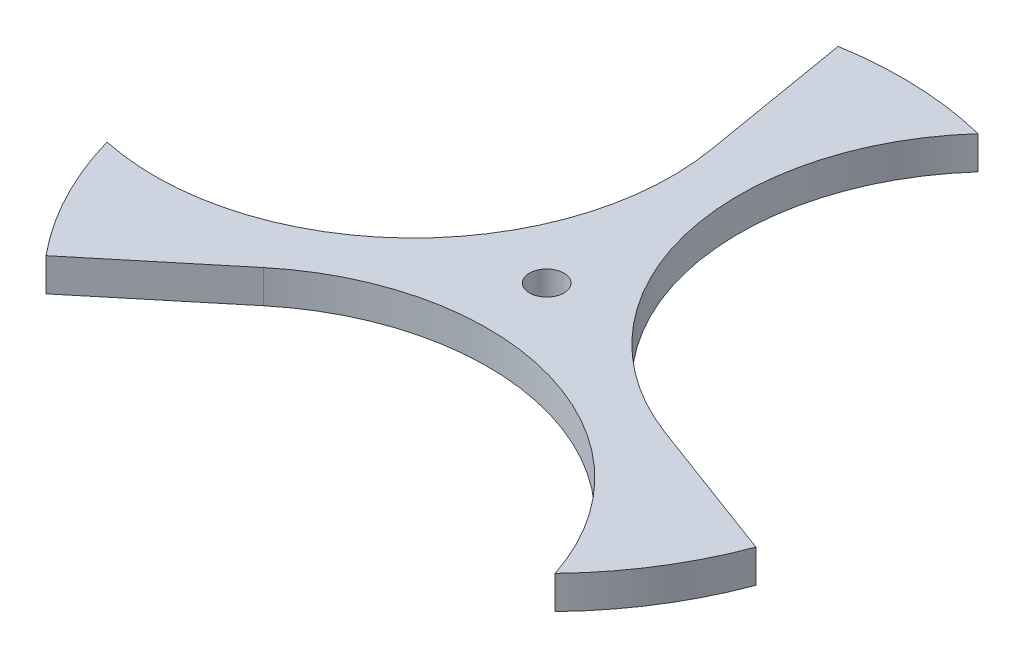
ISO-10303-21;
HEADER;
FILE_DESCRIPTION(('STEP AP214'),'2;1');
FILE_NAME('part.step','',(''),(''),'','','');
FILE_SCHEMA(('AUTOMOTIVE_DESIGN { 1 0 10303 214 1 1 1 1 }'));
ENDSEC;
DATA;
#1=APPLICATION_CONTEXT('core data for automotive mechanical design processes');
#2=APPLICATION_PROTOCOL_DEFINITION('international standard','automotive_design',2000,#1);
#3=PRODUCT_CONTEXT('',#1,'mechanical');
#4=PRODUCT('Part','Part','',(#3));
#5=PRODUCT_RELATED_PRODUCT_CATEGORY('part','',(#4));
#6=PRODUCT_DEFINITION_FORMATION('','',#4);
#7=PRODUCT_DEFINITION_CONTEXT('part definition',#1,'design');
#8=PRODUCT_DEFINITION('design','',#6,#7);
#9=PRODUCT_DEFINITION_SHAPE('','',#8);
#10=(LENGTH_UNIT() NAMED_UNIT(*) SI_UNIT(.MILLI.,.METRE.));
#11=(NAMED_UNIT(*) PLANE_ANGLE_UNIT() SI_UNIT($,.RADIAN.));
#12=(NAMED_UNIT(*) SI_UNIT($,.STERADIAN.) SOLID_ANGLE_UNIT());
#13=UNCERTAINTY_MEASURE_WITH_UNIT(LENGTH_MEASURE(1.E-05),#10,'distance_accuracy_value','');
#14=(GEOMETRIC_REPRESENTATION_CONTEXT(3) GLOBAL_UNCERTAINTY_ASSIGNED_CONTEXT((#13)) GLOBAL_UNIT_ASSIGNED_CONTEXT((#10,
#11,#12)) REPRESENTATION_CONTEXT('',''));
#15=CARTESIAN_POINT('',(0.,0.,0.));
#16=DIRECTION('',(0.,0.,1.));
#17=DIRECTION('',(1.,0.,0.));
#18=AXIS2_PLACEMENT_3D('',#15,#16,#17);
#19=CARTESIAN_POINT('',(1.81029657284749,3.048,60.2978312322951));
#20=DIRECTION('',(0.,1.,0.));
#21=DIRECTION('',(0.,0.,1.));
#22=AXIS2_PLACEMENT_3D('',#19,#20,#21);
#23=PLANE('',#22);
#24=CARTESIAN_POINT('',(1.81029657284749,3.048,60.2978312322951));
#25=DIRECTION('',(0.,-1.,0.));
#26=DIRECTION('',(0.,0.,1.));
#27=AXIS2_PLACEMENT_3D('',#24,#25,#26);
#28=CIRCLE('',#27,47.625);
#29=CARTESIAN_POINT('',(-28.5363220622247,3.048,23.5932897909763));
#30=VERTEX_POINT('',#29);
#31=CARTESIAN_POINT('',(47.093148028681,3.048,45.546424891579));
#32=VERTEX_POINT('',#31);
#33=EDGE_CURVE('E163',#30,#32,#28,.T.);
#34=ORIENTED_EDGE('',*,*,#33,.T.);
#35=CARTESIAN_POINT('',(0.,3.048,0.));
#36=DIRECTION('',(0.,1.,0.));
#37=DIRECTION('',(0.,0.,1.));
#38=AXIS2_PLACEMENT_3D('',#35,#36,#37);
#39=CIRCLE('',#38,65.5151998520611);
#40=CARTESIAN_POINT('',(61.3995568393179,3.048,22.8546676105973));
#41=VERTEX_POINT('',#40);
#42=EDGE_CURVE('E106',#32,#41,#39,.T.);
#43=ORIENTED_EDGE('',*,*,#42,.T.);
#44=DIRECTION('',(-0.937180333387722,0.,-0.348845270444188));
#45=VECTOR('',#44,1.);
#46=CARTESIAN_POINT('',(34.7005493489459,3.048,12.9165349409727));
#47=LINE('',#46,#45);
#48=CARTESIAN_POINT('',(34.7005493489459,3.048,12.9165349409727));
#49=VERTEX_POINT('',#48);
#50=EDGE_CURVE('E181',#41,#49,#47,.T.);
#51=ORIENTED_EDGE('',*,*,#50,.T.);
#52=CARTESIAN_POINT('',(51.3143053538503,3.048,-31.7166784366176));
#53=DIRECTION('',(0.,-1.,0.));
#54=DIRECTION('',(0.,0.,1.));
#55=AXIS2_PLACEMENT_3D('',#52,#53,#54);
#56=CIRCLE('',#55,47.625);
#57=CARTESIAN_POINT('',(15.8977869933265,3.048,-63.5570749828084));
#58=VERTEX_POINT('',#57);
#59=EDGE_CURVE('E198',#49,#58,#56,.T.);
#60=ORIENTED_EDGE('',*,*,#59,.T.);
#61=CARTESIAN_POINT('',(0.,3.048,0.));
#62=DIRECTION('',(0.,1.,0.));
#63=DIRECTION('',(0.,0.,1.));
#64=AXIS2_PLACEMENT_3D('',#61,#62,#63);
#65=CIRCLE('',#64,65.5151998520611);
#66=CARTESIAN_POINT('',(-10.9070556738326,3.048,-64.6009098092544));
#67=VERTEX_POINT('',#66);
#68=EDGE_CURVE('E197',#58,#67,#65,.T.);
#69=ORIENTED_EDGE('',*,*,#68,.T.);
#70=DIRECTION('',(0.166481300499146,0.,0.98604461186303));
#71=VECTOR('',#70,1.);
#72=CARTESIAN_POINT('',(-6.16422728672149,3.048,-36.509824731949));
#73=LINE('',#72,#71);
#74=CARTESIAN_POINT('',(-6.16422728672147,3.048,-36.509824731949));
#75=VERTEX_POINT('',#74);
#76=EDGE_CURVE('E128',#67,#75,#73,.T.);
#77=ORIENTED_EDGE('',*,*,#76,.T.);
#78=CARTESIAN_POINT('',(-53.1246019266983,3.048,-28.5811527956771));
#79=DIRECTION('',(0.,-1.,0.));
#80=DIRECTION('',(0.,0.,1.));
#81=AXIS2_PLACEMENT_3D('',#78,#79,#80);
#82=CIRCLE('',#81,47.625);
#83=CARTESIAN_POINT('',(-62.9909350220076,3.048,18.01065009123));
#84=VERTEX_POINT('',#83);
#85=EDGE_CURVE('E122',#75,#84,#82,.T.);
#86=ORIENTED_EDGE('',*,*,#85,.T.);
#87=CARTESIAN_POINT('',(0.,3.048,0.));
#88=DIRECTION('',(0.,1.,0.));
#89=DIRECTION('',(0.,0.,1.));
#90=AXIS2_PLACEMENT_3D('',#87,#88,#89);
#91=CIRCLE('',#90,65.5151998520611);
#92=CARTESIAN_POINT('',(-50.4925011654858,3.048,41.746242198657));
#93=VERTEX_POINT('',#92);
#94=EDGE_CURVE('E126',#84,#93,#91,.T.);
#95=ORIENTED_EDGE('',*,*,#94,.T.);
#96=DIRECTION('',(0.770699032888583,0.,-0.637199341418839));
#97=VECTOR('',#96,1.);
#98=CARTESIAN_POINT('',(-28.5363220622247,3.048,23.5932897909763));
#99=LINE('',#98,#97);
#100=EDGE_CURVE('E60',#93,#30,#99,.T.);
#101=ORIENTED_EDGE('',*,*,#100,.T.);
#102=EDGE_LOOP('',(#34,#43,#51,#60,#69,#77,#86,#95,#101));
#103=FACE_BOUND('',#102,.T.);
#104=CARTESIAN_POINT('',(0.,3.048,0.));
#105=DIRECTION('',(0.,1.,0.));
#106=DIRECTION('',(0.,0.,1.));
#107=AXIS2_PLACEMENT_3D('',#104,#105,#106);
#108=CIRCLE('',#107,3.175);
#109=CARTESIAN_POINT('',(0.,3.048,3.17500000000003));
#110=VERTEX_POINT('',#109);
#111=EDGE_CURVE('E150',#110,#110,#108,.T.);
#112=ORIENTED_EDGE('',*,*,#111,.F.);
#113=EDGE_LOOP('',(#112));
#114=FACE_BOUND('',#113,.T.);
#115=ADVANCED_FACE('F43',(#103,#114),#23,.T.);
#116=CARTESIAN_POINT('',(1.81029657284749,-3.048,60.2978312322951));
#117=DIRECTION('',(0.,1.,0.));
#118=DIRECTION('',(0.,0.,1.));
#119=AXIS2_PLACEMENT_3D('',#116,#117,#118);
#120=PLANE('',#119);
#121=CARTESIAN_POINT('',(1.81029657284749,-3.048,60.2978312322951));
#122=DIRECTION('',(0.,-1.,0.));
#123=DIRECTION('',(0.,0.,1.));
#124=AXIS2_PLACEMENT_3D('',#121,#122,#123);
#125=CIRCLE('',#124,47.625);
#126=CARTESIAN_POINT('',(-28.5363220622247,-3.048,23.5932897909763));
#127=VERTEX_POINT('',#126);
#128=CARTESIAN_POINT('',(47.093148028681,-3.048,45.546424891579));
#129=VERTEX_POINT('',#128);
#130=EDGE_CURVE('E146',#127,#129,#125,.T.);
#131=ORIENTED_EDGE('',*,*,#130,.F.);
#132=DIRECTION('',(0.770699032888583,0.,-0.637199341418839));
#133=VECTOR('',#132,1.);
#134=CARTESIAN_POINT('',(-28.5363220622247,-3.048,23.5932897909763));
#135=LINE('',#134,#133);
#136=CARTESIAN_POINT('',(-50.4925011654858,-3.048,41.746242198657));
#137=VERTEX_POINT('',#136);
#138=EDGE_CURVE('E98',#137,#127,#135,.T.);
#139=ORIENTED_EDGE('',*,*,#138,.F.);
#140=CARTESIAN_POINT('',(0.,-3.048,0.));
#141=DIRECTION('',(0.,1.,0.));
#142=DIRECTION('',(0.,0.,1.));
#143=AXIS2_PLACEMENT_3D('',#140,#141,#142);
#144=CIRCLE('',#143,65.5151998520611);
#145=CARTESIAN_POINT('',(-62.9909350220076,-3.048,18.01065009123));
#146=VERTEX_POINT('',#145);
#147=EDGE_CURVE('E92',#146,#137,#144,.T.);
#148=ORIENTED_EDGE('',*,*,#147,.F.);
#149=CARTESIAN_POINT('',(-53.1246019266983,-3.048,-28.5811527956771));
#150=DIRECTION('',(0.,-1.,0.));
#151=DIRECTION('',(0.,0.,1.));
#152=AXIS2_PLACEMENT_3D('',#149,#150,#151);
#153=CIRCLE('',#152,47.625);
#154=CARTESIAN_POINT('',(-6.16422728672147,-3.048,-36.509824731949));
#155=VERTEX_POINT('',#154);
#156=EDGE_CURVE('E136',#155,#146,#153,.T.);
#157=ORIENTED_EDGE('',*,*,#156,.F.);
#158=DIRECTION('',(0.166481300499146,0.,0.98604461186303));
#159=VECTOR('',#158,1.);
#160=CARTESIAN_POINT('',(-6.16422728672149,-3.048,-36.509824731949));
#161=LINE('',#160,#159);
#162=CARTESIAN_POINT('',(-10.9070556738326,-3.048,-64.6009098092544));
#163=VERTEX_POINT('',#162);
#164=EDGE_CURVE('E158',#163,#155,#161,.T.);
#165=ORIENTED_EDGE('',*,*,#164,.F.);
#166=CARTESIAN_POINT('',(0.,-3.048,0.));
#167=DIRECTION('',(0.,1.,0.));
#168=DIRECTION('',(0.,0.,1.));
#169=AXIS2_PLACEMENT_3D('',#166,#167,#168);
#170=CIRCLE('',#169,65.5151998520611);
#171=CARTESIAN_POINT('',(15.8977869933265,-3.048,-63.5570749828084));
#172=VERTEX_POINT('',#171);
#173=EDGE_CURVE('E156',#172,#163,#170,.T.);
#174=ORIENTED_EDGE('',*,*,#173,.F.);
#175=CARTESIAN_POINT('',(51.3143053538503,-3.048,-31.7166784366176));
#176=DIRECTION('',(0.,-1.,0.));
#177=DIRECTION('',(0.,0.,1.));
#178=AXIS2_PLACEMENT_3D('',#175,#176,#177);
#179=CIRCLE('',#178,47.625);
#180=CARTESIAN_POINT('',(34.7005493489459,-3.048,12.9165349409727));
#181=VERTEX_POINT('',#180);
#182=EDGE_CURVE('E154',#181,#172,#179,.T.);
#183=ORIENTED_EDGE('',*,*,#182,.F.);
#184=DIRECTION('',(-0.937180333387722,0.,-0.348845270444188));
#185=VECTOR('',#184,1.);
#186=CARTESIAN_POINT('',(34.7005493489459,-3.048,12.9165349409727));
#187=LINE('',#186,#185);
#188=CARTESIAN_POINT('',(61.3995568393179,-3.048,22.8546676105973));
#189=VERTEX_POINT('',#188);
#190=EDGE_CURVE('E152',#189,#181,#187,.T.);
#191=ORIENTED_EDGE('',*,*,#190,.F.);
#192=CARTESIAN_POINT('',(0.,-3.048,0.));
#193=DIRECTION('',(0.,1.,0.));
#194=DIRECTION('',(0.,0.,1.));
#195=AXIS2_PLACEMENT_3D('',#192,#193,#194);
#196=CIRCLE('',#195,65.5151998520611);
#197=EDGE_CURVE('E149',#129,#189,#196,.T.);
#198=ORIENTED_EDGE('',*,*,#197,.F.);
#199=EDGE_LOOP('',(#131,#139,#148,#157,#165,#174,#183,#191,#198));
#200=FACE_BOUND('',#199,.T.);
#201=CARTESIAN_POINT('',(0.,-3.048,0.));
#202=DIRECTION('',(0.,1.,0.));
#203=DIRECTION('',(0.,0.,1.));
#204=AXIS2_PLACEMENT_3D('',#201,#202,#203);
#205=CIRCLE('',#204,3.175);
#206=CARTESIAN_POINT('',(0.,-3.048,3.17500000000003));
#207=VERTEX_POINT('',#206);
#208=EDGE_CURVE('E205',#207,#207,#205,.T.);
#209=ORIENTED_EDGE('',*,*,#208,.T.);
#210=EDGE_LOOP('',(#209));
#211=FACE_BOUND('',#210,.T.);
#212=ADVANCED_FACE('F185',(#200,#211),#120,.F.);
#213=CARTESIAN_POINT('',(1.81029657284749,3.048,60.2978312322951));
#214=DIRECTION('',(0.,-1.,0.));
#215=DIRECTION('',(0.,0.,-1.));
#216=AXIS2_PLACEMENT_3D('',#213,#214,#215);
#217=CYLINDRICAL_SURFACE('',#216,47.625);
#218=ORIENTED_EDGE('',*,*,#130,.T.);
#219=DIRECTION('',(0.,-1.,0.));
#220=VECTOR('',#219,1.);
#221=CARTESIAN_POINT('',(47.093148028681,3.048,45.546424891579));
#222=LINE('',#221,#220);
#223=EDGE_CURVE('E13',#32,#129,#222,.T.);
#224=ORIENTED_EDGE('',*,*,#223,.F.);
#225=ORIENTED_EDGE('',*,*,#33,.F.);
#226=DIRECTION('',(0.,-1.,0.));
#227=VECTOR('',#226,1.);
#228=CARTESIAN_POINT('',(-28.5363220622247,3.048,23.5932897909763));
#229=LINE('',#228,#227);
#230=EDGE_CURVE('E142',#30,#127,#229,.T.);
#231=ORIENTED_EDGE('',*,*,#230,.T.);
#232=EDGE_LOOP('',(#218,#224,#225,#231));
#233=FACE_BOUND('',#232,.T.);
#234=ADVANCED_FACE('F45',(#233),#217,.F.);
#235=CARTESIAN_POINT('',(0.,3.048,0.));
#236=DIRECTION('',(0.,-1.,0.));
#237=DIRECTION('',(0.,0.,-1.));
#238=AXIS2_PLACEMENT_3D('',#235,#236,#237);
#239=CYLINDRICAL_SURFACE('',#238,65.5151998520611);
#240=ORIENTED_EDGE('',*,*,#197,.T.);
#241=DIRECTION('',(0.,-1.,0.));
#242=VECTOR('',#241,1.);
#243=CARTESIAN_POINT('',(61.3995568393179,3.048,22.8546676105973));
#244=LINE('',#243,#242);
#245=EDGE_CURVE('E52',#41,#189,#244,.T.);
#246=ORIENTED_EDGE('',*,*,#245,.F.);
#247=ORIENTED_EDGE('',*,*,#42,.F.);
#248=ORIENTED_EDGE('',*,*,#223,.T.);
#249=EDGE_LOOP('',(#240,#246,#247,#248));
#250=FACE_BOUND('',#249,.T.);
#251=ADVANCED_FACE('F237',(#250),#239,.T.);
#252=CARTESIAN_POINT('',(34.7005493489459,3.048,12.9165349409727));
#253=DIRECTION('',(-0.348845270444187,0.,0.937180333387722));
#254=DIRECTION('',(0.937180333387722,0.,0.348845270444187));
#255=AXIS2_PLACEMENT_3D('',#252,#253,#254);
#256=PLANE('',#255);
#257=ORIENTED_EDGE('',*,*,#190,.T.);
#258=DIRECTION('',(0.,-1.,0.));
#259=VECTOR('',#258,1.);
#260=CARTESIAN_POINT('',(34.7005493489459,3.048,12.9165349409727));
#261=LINE('',#260,#259);
#262=EDGE_CURVE('E173',#49,#181,#261,.T.);
#263=ORIENTED_EDGE('',*,*,#262,.F.);
#264=ORIENTED_EDGE('',*,*,#50,.F.);
#265=ORIENTED_EDGE('',*,*,#245,.T.);
#266=EDGE_LOOP('',(#257,#263,#264,#265));
#267=FACE_BOUND('',#266,.T.);
#268=ADVANCED_FACE('F179',(#267),#256,.F.);
#269=CARTESIAN_POINT('',(51.3143053538503,3.048,-31.7166784366176));
#270=DIRECTION('',(0.,-1.,0.));
#271=DIRECTION('',(0.,0.,-1.));
#272=AXIS2_PLACEMENT_3D('',#269,#270,#271);
#273=CYLINDRICAL_SURFACE('',#272,47.625);
#274=ORIENTED_EDGE('',*,*,#182,.T.);
#275=DIRECTION('',(0.,-1.,0.));
#276=VECTOR('',#275,1.);
#277=CARTESIAN_POINT('',(15.8977869933265,3.048,-63.5570749828084));
#278=LINE('',#277,#276);
#279=EDGE_CURVE('E170',#58,#172,#278,.T.);
#280=ORIENTED_EDGE('',*,*,#279,.F.);
#281=ORIENTED_EDGE('',*,*,#59,.F.);
#282=ORIENTED_EDGE('',*,*,#262,.T.);
#283=EDGE_LOOP('',(#274,#280,#281,#282));
#284=FACE_BOUND('',#283,.T.);
#285=ADVANCED_FACE('F191',(#284),#273,.F.);
#286=CARTESIAN_POINT('',(0.,3.048,0.));
#287=DIRECTION('',(0.,-1.,0.));
#288=DIRECTION('',(0.,0.,-1.));
#289=AXIS2_PLACEMENT_3D('',#286,#287,#288);
#290=CYLINDRICAL_SURFACE('',#289,65.5151998520611);
#291=ORIENTED_EDGE('',*,*,#173,.T.);
#292=DIRECTION('',(0.,-1.,0.));
#293=VECTOR('',#292,1.);
#294=CARTESIAN_POINT('',(-10.9070556738326,3.048,-64.6009098092544));
#295=LINE('',#294,#293);
#296=EDGE_CURVE('E167',#67,#163,#295,.T.);
#297=ORIENTED_EDGE('',*,*,#296,.F.);
#298=ORIENTED_EDGE('',*,*,#68,.F.);
#299=ORIENTED_EDGE('',*,*,#279,.T.);
#300=EDGE_LOOP('',(#291,#297,#298,#299));
#301=FACE_BOUND('',#300,.T.);
#302=ADVANCED_FACE('F195',(#301),#290,.T.);
#303=CARTESIAN_POINT('',(-6.16422728672149,3.048,-36.509824731949));
#304=DIRECTION('',(0.98604461186303,0.,-0.166481300499146));
#305=DIRECTION('',(-0.166481300499146,0.,-0.98604461186303));
#306=AXIS2_PLACEMENT_3D('',#303,#304,#305);
#307=PLANE('',#306);
#308=ORIENTED_EDGE('',*,*,#164,.T.);
#309=DIRECTION('',(0.,-1.,0.));
#310=VECTOR('',#309,1.);
#311=CARTESIAN_POINT('',(-6.16422728672147,3.048,-36.509824731949));
#312=LINE('',#311,#310);
#313=EDGE_CURVE('E137',#75,#155,#312,.T.);
#314=ORIENTED_EDGE('',*,*,#313,.F.);
#315=ORIENTED_EDGE('',*,*,#76,.F.);
#316=ORIENTED_EDGE('',*,*,#296,.T.);
#317=EDGE_LOOP('',(#308,#314,#315,#316));
#318=FACE_BOUND('',#317,.T.);
#319=ADVANCED_FACE('F228',(#318),#307,.F.);
#320=CARTESIAN_POINT('',(-53.1246019266983,3.048,-28.5811527956771));
#321=DIRECTION('',(0.,-1.,0.));
#322=DIRECTION('',(0.,0.,-1.));
#323=AXIS2_PLACEMENT_3D('',#320,#321,#322);
#324=CYLINDRICAL_SURFACE('',#323,47.625);
#325=ORIENTED_EDGE('',*,*,#156,.T.);
#326=DIRECTION('',(0.,-1.,0.));
#327=VECTOR('',#326,1.);
#328=CARTESIAN_POINT('',(-62.9909350220076,3.048,18.01065009123));
#329=LINE('',#328,#327);
#330=EDGE_CURVE('E133',#84,#146,#329,.T.);
#331=ORIENTED_EDGE('',*,*,#330,.F.);
#332=ORIENTED_EDGE('',*,*,#85,.F.);
#333=ORIENTED_EDGE('',*,*,#313,.T.);
#334=EDGE_LOOP('',(#325,#331,#332,#333));
#335=FACE_BOUND('',#334,.T.);
#336=ADVANCED_FACE('F134',(#335),#324,.F.);
#337=CARTESIAN_POINT('',(0.,3.048,0.));
#338=DIRECTION('',(0.,-1.,0.));
#339=DIRECTION('',(0.,0.,-1.));
#340=AXIS2_PLACEMENT_3D('',#337,#338,#339);
#341=CYLINDRICAL_SURFACE('',#340,65.5151998520611);
#342=ORIENTED_EDGE('',*,*,#147,.T.);
#343=DIRECTION('',(0.,-1.,0.));
#344=VECTOR('',#343,1.);
#345=CARTESIAN_POINT('',(-50.4925011654858,3.048,41.746242198657));
#346=LINE('',#345,#344);
#347=EDGE_CURVE('E138',#93,#137,#346,.T.);
#348=ORIENTED_EDGE('',*,*,#347,.F.);
#349=ORIENTED_EDGE('',*,*,#94,.F.);
#350=ORIENTED_EDGE('',*,*,#330,.T.);
#351=EDGE_LOOP('',(#342,#348,#349,#350));
#352=FACE_BOUND('',#351,.T.);
#353=ADVANCED_FACE('F140',(#352),#341,.T.);
#354=CARTESIAN_POINT('',(-28.5363220622247,3.048,23.5932897909763));
#355=DIRECTION('',(-0.637199341418839,0.,-0.770699032888583));
#356=DIRECTION('',(-0.770699032888583,0.,0.637199341418839));
#357=AXIS2_PLACEMENT_3D('',#354,#355,#356);
#358=PLANE('',#357);
#359=ORIENTED_EDGE('',*,*,#138,.T.);
#360=ORIENTED_EDGE('',*,*,#230,.F.);
#361=ORIENTED_EDGE('',*,*,#100,.F.);
#362=ORIENTED_EDGE('',*,*,#347,.T.);
#363=EDGE_LOOP('',(#359,#360,#361,#362));
#364=FACE_BOUND('',#363,.T.);
#365=ADVANCED_FACE('F221',(#364),#358,.F.);
#366=CARTESIAN_POINT('',(0.,3.048,0.));
#367=DIRECTION('',(0.,-1.,0.));
#368=DIRECTION('',(0.,0.,-1.));
#369=AXIS2_PLACEMENT_3D('',#366,#367,#368);
#370=CYLINDRICAL_SURFACE('',#369,3.175);
#371=ORIENTED_EDGE('',*,*,#111,.T.);
#372=EDGE_LOOP('',(#371));
#373=FACE_BOUND('',#372,.T.);
#374=ORIENTED_EDGE('',*,*,#208,.F.);
#375=EDGE_LOOP('',(#374));
#376=FACE_BOUND('',#375,.T.);
#377=ADVANCED_FACE('F211',(#373,#376),#370,.F.);
#378=CLOSED_SHELL('',(#115,#212,#234,#251,#268,#285,#302,#319,#336,#353,#365,#377));
#379=MANIFOLD_SOLID_BREP('B2',#378);
#380=ADVANCED_BREP_SHAPE_REPRESENTATION('',(#18,#379),#14);
#381=SHAPE_DEFINITION_REPRESENTATION(#9,#380);
ENDSEC;
END-ISO-10303-21;
